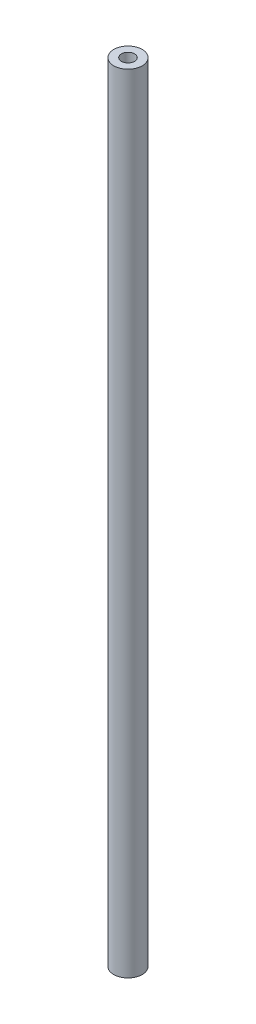
ISO-10303-21;
HEADER;
FILE_DESCRIPTION(('STEP AP214'),'2;1');
FILE_NAME('part.step','',(''),(''),'','','');
FILE_SCHEMA(('AUTOMOTIVE_DESIGN { 1 0 10303 214 1 1 1 1 }'));
ENDSEC;
DATA;
#1=APPLICATION_CONTEXT('core data for automotive mechanical design processes');
#2=APPLICATION_PROTOCOL_DEFINITION('international standard','automotive_design',2000,#1);
#3=PRODUCT_CONTEXT('',#1,'mechanical');
#4=PRODUCT('Part','Part','',(#3));
#5=PRODUCT_RELATED_PRODUCT_CATEGORY('part','',(#4));
#6=PRODUCT_DEFINITION_FORMATION('','',#4);
#7=PRODUCT_DEFINITION_CONTEXT('part definition',#1,'design');
#8=PRODUCT_DEFINITION('design','',#6,#7);
#9=PRODUCT_DEFINITION_SHAPE('','',#8);
#10=(LENGTH_UNIT() NAMED_UNIT(*) SI_UNIT(.MILLI.,.METRE.));
#11=(NAMED_UNIT(*) PLANE_ANGLE_UNIT() SI_UNIT($,.RADIAN.));
#12=(NAMED_UNIT(*) SI_UNIT($,.STERADIAN.) SOLID_ANGLE_UNIT());
#13=UNCERTAINTY_MEASURE_WITH_UNIT(LENGTH_MEASURE(1.E-05),#10,'distance_accuracy_value','');
#14=(GEOMETRIC_REPRESENTATION_CONTEXT(3) GLOBAL_UNCERTAINTY_ASSIGNED_CONTEXT((#13)) GLOBAL_UNIT_ASSIGNED_CONTEXT((#10,
#11,#12)) REPRESENTATION_CONTEXT('',''));
#15=CARTESIAN_POINT('',(0.,0.,0.));
#16=DIRECTION('',(0.,0.,1.));
#17=DIRECTION('',(1.,0.,0.));
#18=AXIS2_PLACEMENT_3D('',#15,#16,#17);
#19=CARTESIAN_POINT('',(0.,108.,0.));
#20=DIRECTION('',(0.,-1.,0.));
#21=DIRECTION('',(0.,0.,-1.));
#22=AXIS2_PLACEMENT_3D('',#19,#20,#21);
#23=CYLINDRICAL_SURFACE('',#22,1.95);
#24=CARTESIAN_POINT('',(0.,108.,0.));
#25=DIRECTION('',(0.,1.,0.));
#26=DIRECTION('',(0.,0.,1.));
#27=AXIS2_PLACEMENT_3D('',#24,#25,#26);
#28=CIRCLE('',#27,1.95);
#29=CARTESIAN_POINT('',(0.,108.,1.95));
#30=VERTEX_POINT('',#29);
#31=EDGE_CURVE('E10',#30,#30,#28,.T.);
#32=ORIENTED_EDGE('',*,*,#31,.F.);
#33=EDGE_LOOP('',(#32));
#34=FACE_BOUND('',#33,.T.);
#35=CARTESIAN_POINT('',(0.,0.,0.));
#36=DIRECTION('',(0.,1.,0.));
#37=DIRECTION('',(0.,0.,1.));
#38=AXIS2_PLACEMENT_3D('',#35,#36,#37);
#39=CIRCLE('',#38,1.95);
#40=CARTESIAN_POINT('',(0.,0.,1.95));
#41=VERTEX_POINT('',#40);
#42=EDGE_CURVE('E39',#41,#41,#39,.T.);
#43=ORIENTED_EDGE('',*,*,#42,.T.);
#44=EDGE_LOOP('',(#43));
#45=FACE_BOUND('',#44,.T.);
#46=ADVANCED_FACE('F32',(#34,#45),#23,.T.);
#47=CARTESIAN_POINT('',(0.,108.,0.));
#48=DIRECTION('',(0.,1.,0.));
#49=DIRECTION('',(0.,0.,1.));
#50=AXIS2_PLACEMENT_3D('',#47,#48,#49);
#51=PLANE('',#50);
#52=CARTESIAN_POINT('',(0.,108.,0.));
#53=DIRECTION('',(0.,1.,0.));
#54=DIRECTION('',(0.,0.,1.));
#55=AXIS2_PLACEMENT_3D('',#52,#53,#54);
#56=CIRCLE('',#55,0.9);
#57=CARTESIAN_POINT('',(0.,108.,0.9));
#58=VERTEX_POINT('',#57);
#59=EDGE_CURVE('E45',#58,#58,#56,.T.);
#60=ORIENTED_EDGE('',*,*,#59,.F.);
#61=EDGE_LOOP('',(#60));
#62=FACE_BOUND('',#61,.T.);
#63=ORIENTED_EDGE('',*,*,#31,.T.);
#64=EDGE_LOOP('',(#63));
#65=FACE_BOUND('',#64,.T.);
#66=ADVANCED_FACE('F61',(#62,#65),#51,.T.);
#67=CARTESIAN_POINT('',(0.,0.,0.));
#68=DIRECTION('',(0.,1.,0.));
#69=DIRECTION('',(0.,0.,1.));
#70=AXIS2_PLACEMENT_3D('',#67,#68,#69);
#71=PLANE('',#70);
#72=CARTESIAN_POINT('',(0.,0.,0.));
#73=DIRECTION('',(0.,1.,0.));
#74=DIRECTION('',(0.,0.,1.));
#75=AXIS2_PLACEMENT_3D('',#72,#73,#74);
#76=CIRCLE('',#75,0.9);
#77=CARTESIAN_POINT('',(0.,0.,0.9));
#78=VERTEX_POINT('',#77);
#79=EDGE_CURVE('E35',#78,#78,#76,.T.);
#80=ORIENTED_EDGE('',*,*,#79,.T.);
#81=EDGE_LOOP('',(#80));
#82=FACE_BOUND('',#81,.T.);
#83=ORIENTED_EDGE('',*,*,#42,.F.);
#84=EDGE_LOOP('',(#83));
#85=FACE_BOUND('',#84,.T.);
#86=ADVANCED_FACE('F52',(#82,#85),#71,.F.);
#87=CARTESIAN_POINT('',(0.,-4.,0.));
#88=DIRECTION('',(0.,1.,0.));
#89=DIRECTION('',(0.,0.,1.));
#90=AXIS2_PLACEMENT_3D('',#87,#88,#89);
#91=CYLINDRICAL_SURFACE('',#90,0.9);
#92=ORIENTED_EDGE('',*,*,#59,.T.);
#93=EDGE_LOOP('',(#92));
#94=FACE_BOUND('',#93,.T.);
#95=ORIENTED_EDGE('',*,*,#79,.F.);
#96=EDGE_LOOP('',(#95));
#97=FACE_BOUND('',#96,.T.);
#98=ADVANCED_FACE('F55',(#94,#97),#91,.F.);
#99=CLOSED_SHELL('',(#46,#66,#86,#98));
#100=MANIFOLD_SOLID_BREP('B2',#99);
#101=ADVANCED_BREP_SHAPE_REPRESENTATION('',(#18,#100),#14);
#102=SHAPE_DEFINITION_REPRESENTATION(#9,#101);
ENDSEC;
END-ISO-10303-21;
